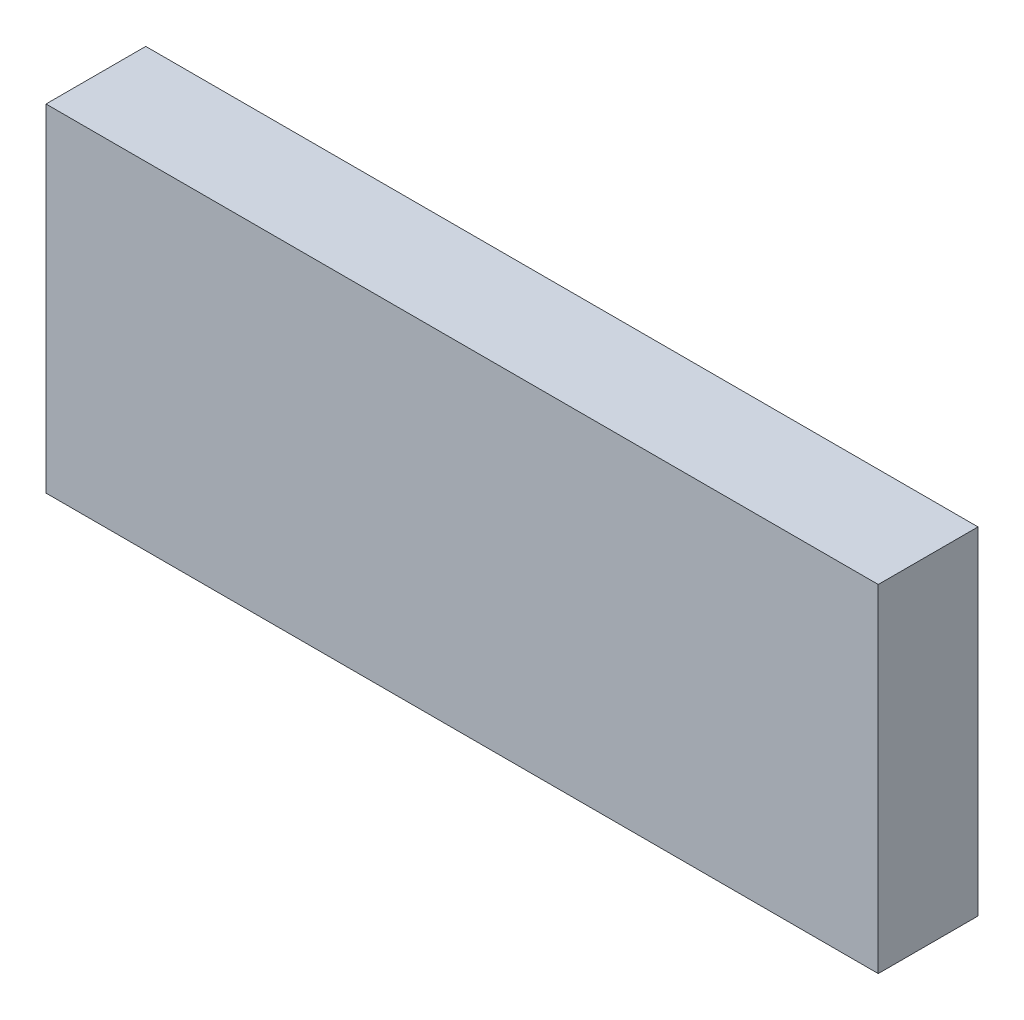
ISO-10303-21;
HEADER;
FILE_DESCRIPTION(('STEP AP214'),'2;1');
FILE_NAME('part.step','',(''),(''),'','','');
FILE_SCHEMA(('AUTOMOTIVE_DESIGN { 1 0 10303 214 1 1 1 1 }'));
ENDSEC;
DATA;
#1=APPLICATION_CONTEXT('core data for automotive mechanical design processes');
#2=APPLICATION_PROTOCOL_DEFINITION('international standard','automotive_design',2000,#1);
#3=PRODUCT_CONTEXT('',#1,'mechanical');
#4=PRODUCT('Part','Part','',(#3));
#5=PRODUCT_RELATED_PRODUCT_CATEGORY('part','',(#4));
#6=PRODUCT_DEFINITION_FORMATION('','',#4);
#7=PRODUCT_DEFINITION_CONTEXT('part definition',#1,'design');
#8=PRODUCT_DEFINITION('design','',#6,#7);
#9=PRODUCT_DEFINITION_SHAPE('','',#8);
#10=(LENGTH_UNIT() NAMED_UNIT(*) SI_UNIT(.MILLI.,.METRE.));
#11=(NAMED_UNIT(*) PLANE_ANGLE_UNIT() SI_UNIT($,.RADIAN.));
#12=(NAMED_UNIT(*) SI_UNIT($,.STERADIAN.) SOLID_ANGLE_UNIT());
#13=UNCERTAINTY_MEASURE_WITH_UNIT(LENGTH_MEASURE(1.E-05),#10,'distance_accuracy_value','');
#14=(GEOMETRIC_REPRESENTATION_CONTEXT(3) GLOBAL_UNCERTAINTY_ASSIGNED_CONTEXT((#13)) GLOBAL_UNIT_ASSIGNED_CONTEXT((#10,
#11,#12)) REPRESENTATION_CONTEXT('',''));
#15=CARTESIAN_POINT('',(0.,0.,0.));
#16=DIRECTION('',(0.,0.,1.));
#17=DIRECTION('',(1.,0.,0.));
#18=AXIS2_PLACEMENT_3D('',#15,#16,#17);
#19=CARTESIAN_POINT('',(1.5434945,-0.62500002,0.36999926));
#20=DIRECTION('',(0.,0.,1.));
#21=DIRECTION('',(1.,0.,0.));
#22=AXIS2_PLACEMENT_3D('',#19,#20,#21);
#23=PLANE('',#22);
#24=DIRECTION('',(0.,-1.,0.));
#25=VECTOR('',#24,1.);
#26=CARTESIAN_POINT('',(1.5434945,0.62500002,0.36999926));
#27=LINE('',#26,#25);
#28=CARTESIAN_POINT('',(1.5434945,0.62500002,0.36999926));
#29=VERTEX_POINT('',#28);
#30=CARTESIAN_POINT('',(1.5434945,-0.62500002,0.36999926));
#31=VERTEX_POINT('',#30);
#32=EDGE_CURVE('E28',#29,#31,#27,.T.);
#33=ORIENTED_EDGE('',*,*,#32,.F.);
#34=DIRECTION('',(1.,0.,0.));
#35=VECTOR('',#34,1.);
#36=CARTESIAN_POINT('',(-1.54349196,0.62500002,0.36999926));
#37=LINE('',#36,#35);
#38=CARTESIAN_POINT('',(-1.54349196,0.62500002,0.36999926));
#39=VERTEX_POINT('',#38);
#40=EDGE_CURVE('E74',#39,#29,#37,.T.);
#41=ORIENTED_EDGE('',*,*,#40,.F.);
#42=DIRECTION('',(0.,1.,0.));
#43=VECTOR('',#42,1.);
#44=CARTESIAN_POINT('',(-1.54349196,-0.62500002,0.36999926));
#45=LINE('',#44,#43);
#46=CARTESIAN_POINT('',(-1.54349196,-0.62500002,0.36999926));
#47=VERTEX_POINT('',#46);
#48=EDGE_CURVE('E81',#47,#39,#45,.T.);
#49=ORIENTED_EDGE('',*,*,#48,.F.);
#50=DIRECTION('',(-1.,0.,0.));
#51=VECTOR('',#50,1.);
#52=CARTESIAN_POINT('',(1.5434945,-0.62500002,0.36999926));
#53=LINE('',#52,#51);
#54=EDGE_CURVE('E84',#31,#47,#53,.T.);
#55=ORIENTED_EDGE('',*,*,#54,.F.);
#56=EDGE_LOOP('',(#33,#41,#49,#55));
#57=FACE_BOUND('',#56,.T.);
#58=ADVANCED_FACE('F17',(#57),#23,.T.);
#59=CARTESIAN_POINT('',(1.5434945,-0.62500002,0.));
#60=DIRECTION('',(0.,0.,1.));
#61=DIRECTION('',(1.,0.,0.));
#62=AXIS2_PLACEMENT_3D('',#59,#60,#61);
#63=PLANE('',#62);
#64=DIRECTION('',(-1.,0.,0.));
#65=VECTOR('',#64,1.);
#66=CARTESIAN_POINT('',(1.5434945,-0.62500002,0.));
#67=LINE('',#66,#65);
#68=CARTESIAN_POINT('',(1.5434945,-0.62500002,0.));
#69=VERTEX_POINT('',#68);
#70=CARTESIAN_POINT('',(-1.54349196,-0.62500002,0.));
#71=VERTEX_POINT('',#70);
#72=EDGE_CURVE('E21',#69,#71,#67,.T.);
#73=ORIENTED_EDGE('',*,*,#72,.T.);
#74=DIRECTION('',(0.,1.,0.));
#75=VECTOR('',#74,1.);
#76=CARTESIAN_POINT('',(-1.54349196,-0.62500002,0.));
#77=LINE('',#76,#75);
#78=CARTESIAN_POINT('',(-1.54349196,0.62500002,0.));
#79=VERTEX_POINT('',#78);
#80=EDGE_CURVE('E63',#71,#79,#77,.T.);
#81=ORIENTED_EDGE('',*,*,#80,.T.);
#82=DIRECTION('',(1.,0.,0.));
#83=VECTOR('',#82,1.);
#84=CARTESIAN_POINT('',(-1.54349196,0.62500002,0.));
#85=LINE('',#84,#83);
#86=CARTESIAN_POINT('',(1.5434945,0.62500002,0.));
#87=VERTEX_POINT('',#86);
#88=EDGE_CURVE('E99',#79,#87,#85,.T.);
#89=ORIENTED_EDGE('',*,*,#88,.T.);
#90=DIRECTION('',(0.,-1.,0.));
#91=VECTOR('',#90,1.);
#92=CARTESIAN_POINT('',(1.5434945,0.62500002,0.));
#93=LINE('',#92,#91);
#94=EDGE_CURVE('E11',#87,#69,#93,.T.);
#95=ORIENTED_EDGE('',*,*,#94,.T.);
#96=EDGE_LOOP('',(#73,#81,#89,#95));
#97=FACE_BOUND('',#96,.T.);
#98=ADVANCED_FACE('F19',(#97),#63,.F.);
#99=CARTESIAN_POINT('',(1.5434945,0.62500002,0.));
#100=DIRECTION('',(1.,0.,0.));
#101=DIRECTION('',(0.,1.,0.));
#102=AXIS2_PLACEMENT_3D('',#99,#100,#101);
#103=PLANE('',#102);
#104=DIRECTION('',(0.,0.,1.));
#105=VECTOR('',#104,1.);
#106=CARTESIAN_POINT('',(1.5434945,0.62500002,0.));
#107=LINE('',#106,#105);
#108=EDGE_CURVE('E104',#87,#29,#107,.T.);
#109=ORIENTED_EDGE('',*,*,#108,.T.);
#110=ORIENTED_EDGE('',*,*,#32,.T.);
#111=DIRECTION('',(0.,0.,1.));
#112=VECTOR('',#111,1.);
#113=CARTESIAN_POINT('',(1.5434945,-0.62500002,0.));
#114=LINE('',#113,#112);
#115=EDGE_CURVE('E91',#69,#31,#114,.T.);
#116=ORIENTED_EDGE('',*,*,#115,.F.);
#117=ORIENTED_EDGE('',*,*,#94,.F.);
#118=EDGE_LOOP('',(#109,#110,#116,#117));
#119=FACE_BOUND('',#118,.T.);
#120=ADVANCED_FACE('F117',(#119),#103,.T.);
#121=CARTESIAN_POINT('',(-1.54349196,0.62500002,0.));
#122=DIRECTION('',(0.,1.,0.));
#123=DIRECTION('',(1.,0.,0.));
#124=AXIS2_PLACEMENT_3D('',#121,#122,#123);
#125=PLANE('',#124);
#126=DIRECTION('',(0.,0.,1.));
#127=VECTOR('',#126,1.);
#128=CARTESIAN_POINT('',(-1.54349196,0.62500002,0.));
#129=LINE('',#128,#127);
#130=EDGE_CURVE('E71',#79,#39,#129,.T.);
#131=ORIENTED_EDGE('',*,*,#130,.T.);
#132=ORIENTED_EDGE('',*,*,#40,.T.);
#133=ORIENTED_EDGE('',*,*,#108,.F.);
#134=ORIENTED_EDGE('',*,*,#88,.F.);
#135=EDGE_LOOP('',(#131,#132,#133,#134));
#136=FACE_BOUND('',#135,.T.);
#137=ADVANCED_FACE('F116',(#136),#125,.T.);
#138=CARTESIAN_POINT('',(-1.54349196,-0.62500002,0.));
#139=DIRECTION('',(-1.,0.,0.));
#140=DIRECTION('',(0.,0.,1.));
#141=AXIS2_PLACEMENT_3D('',#138,#139,#140);
#142=PLANE('',#141);
#143=DIRECTION('',(0.,0.,1.));
#144=VECTOR('',#143,1.);
#145=CARTESIAN_POINT('',(-1.54349196,-0.62500002,0.));
#146=LINE('',#145,#144);
#147=EDGE_CURVE('E68',#71,#47,#146,.T.);
#148=ORIENTED_EDGE('',*,*,#147,.T.);
#149=ORIENTED_EDGE('',*,*,#48,.T.);
#150=ORIENTED_EDGE('',*,*,#130,.F.);
#151=ORIENTED_EDGE('',*,*,#80,.F.);
#152=EDGE_LOOP('',(#148,#149,#150,#151));
#153=FACE_BOUND('',#152,.T.);
#154=ADVANCED_FACE('F65',(#153),#142,.T.);
#155=CARTESIAN_POINT('',(1.5434945,-0.62500002,0.));
#156=DIRECTION('',(0.,-1.,0.));
#157=DIRECTION('',(0.,0.,-1.));
#158=AXIS2_PLACEMENT_3D('',#155,#156,#157);
#159=PLANE('',#158);
#160=ORIENTED_EDGE('',*,*,#115,.T.);
#161=ORIENTED_EDGE('',*,*,#54,.T.);
#162=ORIENTED_EDGE('',*,*,#147,.F.);
#163=ORIENTED_EDGE('',*,*,#72,.F.);
#164=EDGE_LOOP('',(#160,#161,#162,#163));
#165=FACE_BOUND('',#164,.T.);
#166=ADVANCED_FACE('F82',(#165),#159,.T.);
#167=CLOSED_SHELL('',(#58,#98,#120,#137,#154,#166));
#168=MANIFOLD_SOLID_BREP('B1',#167);
#169=ADVANCED_BREP_SHAPE_REPRESENTATION('',(#18,#168),#14);
#170=SHAPE_DEFINITION_REPRESENTATION(#9,#169);
ENDSEC;
END-ISO-10303-21;
